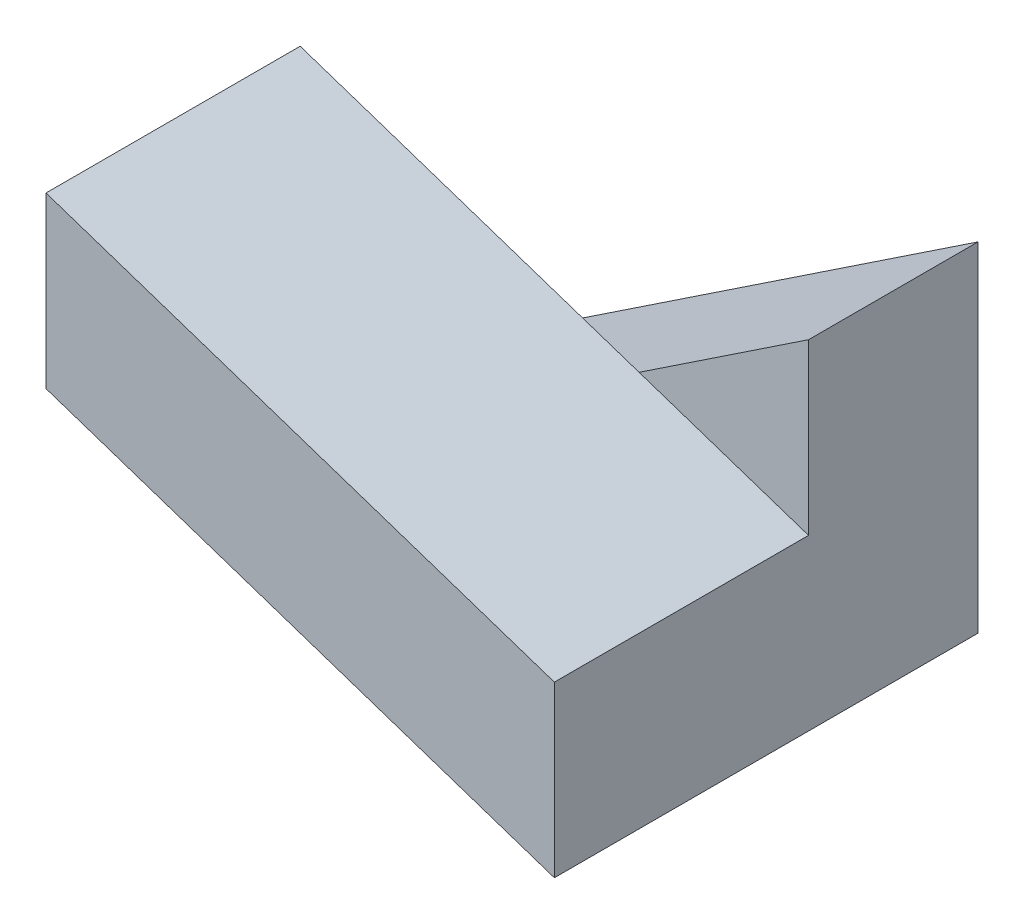
ISO-10303-21;
HEADER;
FILE_DESCRIPTION(('STEP AP214'),'2;1');
FILE_NAME('part.step','',(''),(''),'','','');
FILE_SCHEMA(('AUTOMOTIVE_DESIGN { 1 0 10303 214 1 1 1 1 }'));
ENDSEC;
DATA;
#1=APPLICATION_CONTEXT('core data for automotive mechanical design processes');
#2=APPLICATION_PROTOCOL_DEFINITION('international standard','automotive_design',2000,#1);
#3=PRODUCT_CONTEXT('',#1,'mechanical');
#4=PRODUCT('Part','Part','',(#3));
#5=PRODUCT_RELATED_PRODUCT_CATEGORY('part','',(#4));
#6=PRODUCT_DEFINITION_FORMATION('','',#4);
#7=PRODUCT_DEFINITION_CONTEXT('part definition',#1,'design');
#8=PRODUCT_DEFINITION('design','',#6,#7);
#9=PRODUCT_DEFINITION_SHAPE('','',#8);
#10=(LENGTH_UNIT() NAMED_UNIT(*) SI_UNIT(.MILLI.,.METRE.));
#11=(NAMED_UNIT(*) PLANE_ANGLE_UNIT() SI_UNIT($,.RADIAN.));
#12=(NAMED_UNIT(*) SI_UNIT($,.STERADIAN.) SOLID_ANGLE_UNIT());
#13=UNCERTAINTY_MEASURE_WITH_UNIT(LENGTH_MEASURE(1.E-05),#10,'distance_accuracy_value','');
#14=(GEOMETRIC_REPRESENTATION_CONTEXT(3) GLOBAL_UNCERTAINTY_ASSIGNED_CONTEXT((#13)) GLOBAL_UNIT_ASSIGNED_CONTEXT((#10,
#11,#12)) REPRESENTATION_CONTEXT('',''));
#15=CARTESIAN_POINT('',(0.,0.,0.));
#16=DIRECTION('',(0.,0.,1.));
#17=DIRECTION('',(1.,0.,0.));
#18=AXIS2_PLACEMENT_3D('',#15,#16,#17);
#19=CARTESIAN_POINT('',(0.,0.,10.));
#20=DIRECTION('',(0.,0.,-1.));
#21=DIRECTION('',(-1.,0.,0.));
#22=AXIS2_PLACEMENT_3D('',#19,#20,#21);
#23=PLANE('',#22);
#24=DIRECTION('',(-0.948683298050514,0.316227766016838,0.));
#25=VECTOR('',#24,1.);
#26=CARTESIAN_POINT('',(-30.,20.,10.));
#27=LINE('',#26,#25);
#28=CARTESIAN_POINT('',(0.,10.,10.));
#29=VERTEX_POINT('',#28);
#30=CARTESIAN_POINT('',(-9.99999999999999,13.3333333333333,10.));
#31=VERTEX_POINT('',#30);
#32=EDGE_CURVE('E51',#29,#31,#27,.T.);
#33=ORIENTED_EDGE('',*,*,#32,.F.);
#34=DIRECTION('',(0.,1.,0.));
#35=VECTOR('',#34,1.);
#36=CARTESIAN_POINT('',(0.,0.,10.));
#37=LINE('',#36,#35);
#38=CARTESIAN_POINT('',(0.,20.,10.));
#39=VERTEX_POINT('',#38);
#40=EDGE_CURVE('E137',#29,#39,#37,.T.);
#41=ORIENTED_EDGE('',*,*,#40,.T.);
#42=DIRECTION('',(-0.832050294337844,-0.554700196225229,0.));
#43=VECTOR('',#42,1.);
#44=CARTESIAN_POINT('',(0.,20.,10.));
#45=LINE('',#44,#43);
#46=EDGE_CURVE('E131',#39,#31,#45,.T.);
#47=ORIENTED_EDGE('',*,*,#46,.T.);
#48=EDGE_LOOP('',(#33,#41,#47));
#49=FACE_BOUND('',#48,.T.);
#50=ADVANCED_FACE('F33',(#49),#23,.F.);
#51=DIRECTION('',(0.948683298050514,-0.316227766016838,0.));
#52=VECTOR('',#51,1.);
#53=CARTESIAN_POINT('',(0.,0.,10.));
#54=LINE('',#53,#52);
#55=CARTESIAN_POINT('',(-20.,6.66666666666667,10.));
#56=VERTEX_POINT('',#55);
#57=CARTESIAN_POINT('',(0.,0.,10.));
#58=VERTEX_POINT('',#57);
#59=EDGE_CURVE('E11',#56,#58,#54,.T.);
#60=ORIENTED_EDGE('',*,*,#59,.F.);
#61=CARTESIAN_POINT('',(-30.,0.,10.));
#62=VERTEX_POINT('',#61);
#63=EDGE_CURVE('E135',#56,#62,#45,.T.);
#64=ORIENTED_EDGE('',*,*,#63,.T.);
#65=DIRECTION('',(1.,0.,0.));
#66=VECTOR('',#65,1.);
#67=CARTESIAN_POINT('',(-30.,0.,10.));
#68=LINE('',#67,#66);
#69=EDGE_CURVE('E133',#62,#58,#68,.T.);
#70=ORIENTED_EDGE('',*,*,#69,.T.);
#71=EDGE_LOOP('',(#60,#64,#70));
#72=FACE_BOUND('',#71,.T.);
#73=ADVANCED_FACE('F191',(#72),#23,.F.);
#74=CARTESIAN_POINT('',(0.,20.,10.));
#75=DIRECTION('',(0.554700196225229,-0.832050294337844,0.));
#76=DIRECTION('',(0.832050294337844,0.554700196225229,0.));
#77=AXIS2_PLACEMENT_3D('',#74,#75,#76);
#78=PLANE('',#77);
#79=DIRECTION('',(-0.832050294337844,-0.554700196225229,0.));
#80=VECTOR('',#79,1.);
#81=CARTESIAN_POINT('',(0.,20.,0.));
#82=LINE('',#81,#80);
#83=CARTESIAN_POINT('',(0.,20.,0.));
#84=VERTEX_POINT('',#83);
#85=CARTESIAN_POINT('',(-30.,0.,0.));
#86=VERTEX_POINT('',#85);
#87=EDGE_CURVE('E122',#84,#86,#82,.T.);
#88=ORIENTED_EDGE('',*,*,#87,.T.);
#89=DIRECTION('',(0.,0.,-1.));
#90=VECTOR('',#89,1.);
#91=CARTESIAN_POINT('',(-30.,0.,10.));
#92=LINE('',#91,#90);
#93=EDGE_CURVE('E42',#62,#86,#92,.T.);
#94=ORIENTED_EDGE('',*,*,#93,.F.);
#95=ORIENTED_EDGE('',*,*,#63,.F.);
#96=EDGE_CURVE('E134',#31,#56,#45,.T.);
#97=ORIENTED_EDGE('',*,*,#96,.F.);
#98=ORIENTED_EDGE('',*,*,#46,.F.);
#99=DIRECTION('',(0.,0.,-1.));
#100=VECTOR('',#99,1.);
#101=CARTESIAN_POINT('',(0.,20.,10.));
#102=LINE('',#101,#100);
#103=EDGE_CURVE('E143',#39,#84,#102,.T.);
#104=ORIENTED_EDGE('',*,*,#103,.T.);
#105=EDGE_LOOP('',(#88,#94,#95,#97,#98,#104));
#106=FACE_BOUND('',#105,.T.);
#107=ADVANCED_FACE('F35',(#106),#78,.F.);
#108=CARTESIAN_POINT('',(-30.,0.,10.));
#109=DIRECTION('',(0.,1.,0.));
#110=DIRECTION('',(0.,0.,1.));
#111=AXIS2_PLACEMENT_3D('',#108,#109,#110);
#112=PLANE('',#111);
#113=DIRECTION('',(1.,0.,0.));
#114=VECTOR('',#113,1.);
#115=CARTESIAN_POINT('',(-30.,0.,0.));
#116=LINE('',#115,#114);
#117=CARTESIAN_POINT('',(0.,0.,0.));
#118=VERTEX_POINT('',#117);
#119=EDGE_CURVE('E125',#86,#118,#116,.T.);
#120=ORIENTED_EDGE('',*,*,#119,.T.);
#121=DIRECTION('',(0.,0.,-1.));
#122=VECTOR('',#121,1.);
#123=CARTESIAN_POINT('',(0.,0.,10.));
#124=LINE('',#123,#122);
#125=EDGE_CURVE('E173',#58,#118,#124,.T.);
#126=ORIENTED_EDGE('',*,*,#125,.F.);
#127=ORIENTED_EDGE('',*,*,#69,.F.);
#128=ORIENTED_EDGE('',*,*,#93,.T.);
#129=EDGE_LOOP('',(#120,#126,#127,#128));
#130=FACE_BOUND('',#129,.T.);
#131=ADVANCED_FACE('F177',(#130),#112,.F.);
#132=CARTESIAN_POINT('',(0.,0.,10.));
#133=DIRECTION('',(-1.,0.,0.));
#134=DIRECTION('',(0.,0.,1.));
#135=AXIS2_PLACEMENT_3D('',#132,#133,#134);
#136=PLANE('',#135);
#137=DIRECTION('',(0.,1.,0.));
#138=VECTOR('',#137,1.);
#139=CARTESIAN_POINT('',(0.,0.,0.));
#140=LINE('',#139,#138);
#141=EDGE_CURVE('E168',#118,#84,#140,.T.);
#142=ORIENTED_EDGE('',*,*,#141,.T.);
#143=ORIENTED_EDGE('',*,*,#103,.F.);
#144=ORIENTED_EDGE('',*,*,#40,.F.);
#145=DIRECTION('',(0.,0.,-1.));
#146=VECTOR('',#145,1.);
#147=CARTESIAN_POINT('',(0.,10.,25.));
#148=LINE('',#147,#146);
#149=CARTESIAN_POINT('',(0.,10.,25.));
#150=VERTEX_POINT('',#149);
#151=EDGE_CURVE('E147',#150,#29,#148,.T.);
#152=ORIENTED_EDGE('',*,*,#151,.F.);
#153=DIRECTION('',(0.,1.,0.));
#154=VECTOR('',#153,1.);
#155=CARTESIAN_POINT('',(0.,10.,25.));
#156=LINE('',#155,#154);
#157=CARTESIAN_POINT('',(0.,0.,25.));
#158=VERTEX_POINT('',#157);
#159=EDGE_CURVE('E113',#158,#150,#156,.T.);
#160=ORIENTED_EDGE('',*,*,#159,.F.);
#161=DIRECTION('',(0.,0.,-1.));
#162=VECTOR('',#161,1.);
#163=CARTESIAN_POINT('',(0.,0.,25.));
#164=LINE('',#163,#162);
#165=EDGE_CURVE('E127',#158,#58,#164,.T.);
#166=ORIENTED_EDGE('',*,*,#165,.T.);
#167=ORIENTED_EDGE('',*,*,#125,.T.);
#168=EDGE_LOOP('',(#142,#143,#144,#152,#160,#166,#167));
#169=FACE_BOUND('',#168,.T.);
#170=ADVANCED_FACE('F159',(#169),#136,.F.);
#171=CARTESIAN_POINT('',(0.,0.,0.));
#172=DIRECTION('',(0.,0.,-1.));
#173=DIRECTION('',(-1.,0.,0.));
#174=AXIS2_PLACEMENT_3D('',#171,#172,#173);
#175=PLANE('',#174);
#176=ORIENTED_EDGE('',*,*,#87,.F.);
#177=ORIENTED_EDGE('',*,*,#141,.F.);
#178=ORIENTED_EDGE('',*,*,#119,.F.);
#179=EDGE_LOOP('',(#176,#177,#178));
#180=FACE_BOUND('',#179,.T.);
#181=ADVANCED_FACE('F180',(#180),#175,.T.);
#182=CARTESIAN_POINT('',(-30.,20.,25.));
#183=DIRECTION('',(-0.316227766016838,-0.948683298050514,0.));
#184=DIRECTION('',(0.948683298050514,-0.316227766016838,0.));
#185=AXIS2_PLACEMENT_3D('',#182,#183,#184);
#186=PLANE('',#185);
#187=ORIENTED_EDGE('',*,*,#32,.T.);
#188=CARTESIAN_POINT('',(-30.,20.,10.));
#189=VERTEX_POINT('',#188);
#190=EDGE_CURVE('E120',#31,#189,#27,.T.);
#191=ORIENTED_EDGE('',*,*,#190,.T.);
#192=DIRECTION('',(0.,0.,-1.));
#193=VECTOR('',#192,1.);
#194=CARTESIAN_POINT('',(-30.,20.,25.));
#195=LINE('',#194,#193);
#196=CARTESIAN_POINT('',(-30.,20.,25.));
#197=VERTEX_POINT('',#196);
#198=EDGE_CURVE('E102',#197,#189,#195,.T.);
#199=ORIENTED_EDGE('',*,*,#198,.F.);
#200=DIRECTION('',(-0.948683298050514,0.316227766016838,0.));
#201=VECTOR('',#200,1.);
#202=CARTESIAN_POINT('',(-30.,20.,25.));
#203=LINE('',#202,#201);
#204=EDGE_CURVE('E108',#150,#197,#203,.T.);
#205=ORIENTED_EDGE('',*,*,#204,.F.);
#206=ORIENTED_EDGE('',*,*,#151,.T.);
#207=EDGE_LOOP('',(#187,#191,#199,#205,#206));
#208=FACE_BOUND('',#207,.T.);
#209=ADVANCED_FACE('F118',(#208),#186,.F.);
#210=CARTESIAN_POINT('',(-30.,10.,25.));
#211=DIRECTION('',(1.,0.,0.));
#212=DIRECTION('',(0.,0.,-1.));
#213=AXIS2_PLACEMENT_3D('',#210,#211,#212);
#214=PLANE('',#213);
#215=DIRECTION('',(0.,-1.,0.));
#216=VECTOR('',#215,1.);
#217=CARTESIAN_POINT('',(-30.,10.,10.));
#218=LINE('',#217,#216);
#219=CARTESIAN_POINT('',(-30.,10.,10.));
#220=VERTEX_POINT('',#219);
#221=EDGE_CURVE('E146',#189,#220,#218,.T.);
#222=ORIENTED_EDGE('',*,*,#221,.T.);
#223=DIRECTION('',(0.,0.,-1.));
#224=VECTOR('',#223,1.);
#225=CARTESIAN_POINT('',(-30.,10.,25.));
#226=LINE('',#225,#224);
#227=CARTESIAN_POINT('',(-30.,10.,25.));
#228=VERTEX_POINT('',#227);
#229=EDGE_CURVE('E104',#228,#220,#226,.T.);
#230=ORIENTED_EDGE('',*,*,#229,.F.);
#231=DIRECTION('',(0.,-1.,0.));
#232=VECTOR('',#231,1.);
#233=CARTESIAN_POINT('',(-30.,10.,25.));
#234=LINE('',#233,#232);
#235=EDGE_CURVE('E98',#197,#228,#234,.T.);
#236=ORIENTED_EDGE('',*,*,#235,.F.);
#237=ORIENTED_EDGE('',*,*,#198,.T.);
#238=EDGE_LOOP('',(#222,#230,#236,#237));
#239=FACE_BOUND('',#238,.T.);
#240=ADVANCED_FACE('F100',(#239),#214,.F.);
#241=CARTESIAN_POINT('',(0.,0.,25.));
#242=DIRECTION('',(0.316227766016838,0.948683298050514,0.));
#243=DIRECTION('',(-0.948683298050514,0.316227766016838,0.));
#244=AXIS2_PLACEMENT_3D('',#241,#242,#243);
#245=PLANE('',#244);
#246=EDGE_CURVE('E44',#220,#56,#54,.T.);
#247=ORIENTED_EDGE('',*,*,#246,.T.);
#248=ORIENTED_EDGE('',*,*,#59,.T.);
#249=ORIENTED_EDGE('',*,*,#165,.F.);
#250=DIRECTION('',(0.948683298050514,-0.316227766016838,0.));
#251=VECTOR('',#250,1.);
#252=CARTESIAN_POINT('',(0.,0.,25.));
#253=LINE('',#252,#251);
#254=EDGE_CURVE('E107',#228,#158,#253,.T.);
#255=ORIENTED_EDGE('',*,*,#254,.F.);
#256=ORIENTED_EDGE('',*,*,#229,.T.);
#257=EDGE_LOOP('',(#247,#248,#249,#255,#256));
#258=FACE_BOUND('',#257,.T.);
#259=ADVANCED_FACE('F158',(#258),#245,.F.);
#260=CARTESIAN_POINT('',(0.,0.,25.));
#261=DIRECTION('',(0.,0.,-1.));
#262=DIRECTION('',(-1.,0.,0.));
#263=AXIS2_PLACEMENT_3D('',#260,#261,#262);
#264=PLANE('',#263);
#265=ORIENTED_EDGE('',*,*,#204,.T.);
#266=ORIENTED_EDGE('',*,*,#235,.T.);
#267=ORIENTED_EDGE('',*,*,#254,.T.);
#268=ORIENTED_EDGE('',*,*,#159,.T.);
#269=EDGE_LOOP('',(#265,#266,#267,#268));
#270=FACE_BOUND('',#269,.T.);
#271=ADVANCED_FACE('F111',(#270),#264,.F.);
#272=CARTESIAN_POINT('',(0.,0.,10.));
#273=DIRECTION('',(0.,0.,-1.));
#274=DIRECTION('',(-1.,0.,0.));
#275=AXIS2_PLACEMENT_3D('',#272,#273,#274);
#276=PLANE('',#275);
#277=ORIENTED_EDGE('',*,*,#190,.F.);
#278=ORIENTED_EDGE('',*,*,#96,.T.);
#279=ORIENTED_EDGE('',*,*,#246,.F.);
#280=ORIENTED_EDGE('',*,*,#221,.F.);
#281=EDGE_LOOP('',(#277,#278,#279,#280));
#282=FACE_BOUND('',#281,.T.);
#283=ADVANCED_FACE('F166',(#282),#276,.T.);
#284=CLOSED_SHELL('',(#50,#73,#107,#131,#170,#181,#209,#240,#259,#271,#283));
#285=MANIFOLD_SOLID_BREP('B2',#284);
#286=ADVANCED_BREP_SHAPE_REPRESENTATION('',(#18,#285),#14);
#287=SHAPE_DEFINITION_REPRESENTATION(#9,#286);
ENDSEC;
END-ISO-10303-21;
